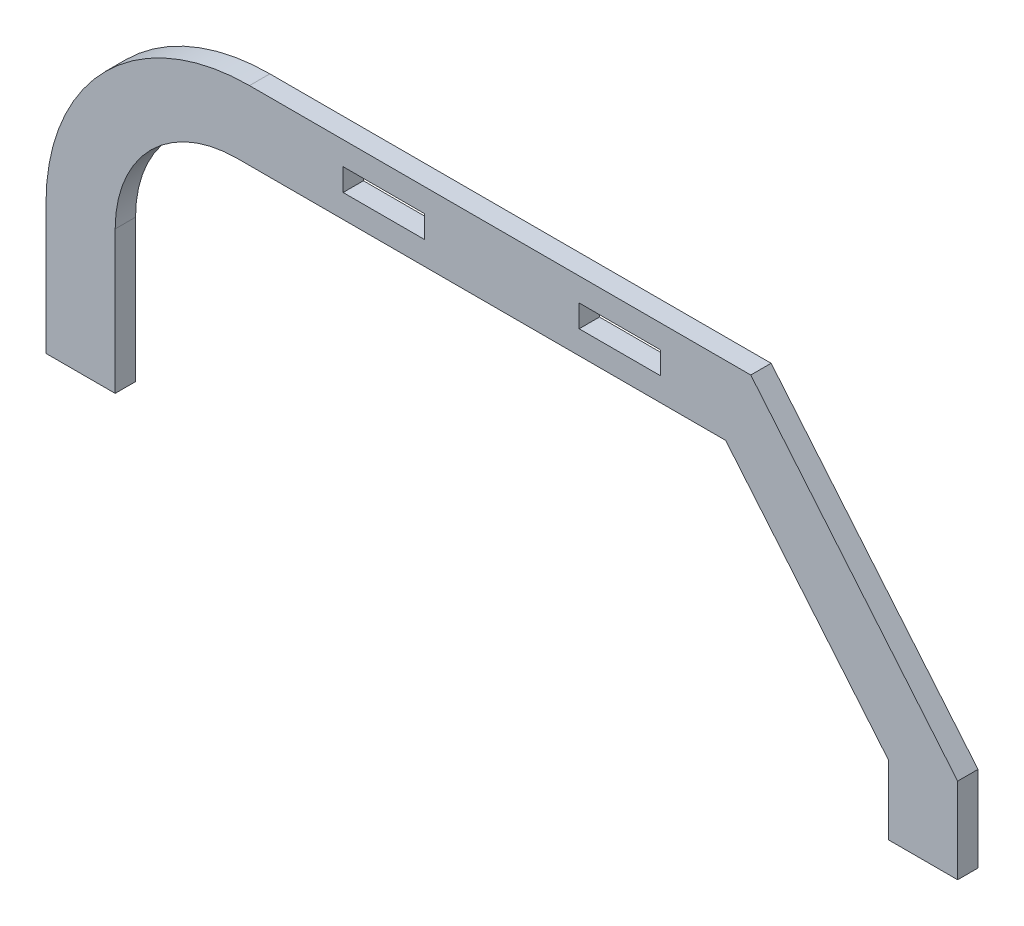
ISO-10303-21;
HEADER;
FILE_DESCRIPTION(('STEP AP214'),'2;1');
FILE_NAME('part.step','',(''),(''),'','','');
FILE_SCHEMA(('AUTOMOTIVE_DESIGN { 1 0 10303 214 1 1 1 1 }'));
ENDSEC;
DATA;
#1=APPLICATION_CONTEXT('core data for automotive mechanical design processes');
#2=APPLICATION_PROTOCOL_DEFINITION('international standard','automotive_design',2000,#1);
#3=PRODUCT_CONTEXT('',#1,'mechanical');
#4=PRODUCT('Part','Part','',(#3));
#5=PRODUCT_RELATED_PRODUCT_CATEGORY('part','',(#4));
#6=PRODUCT_DEFINITION_FORMATION('','',#4);
#7=PRODUCT_DEFINITION_CONTEXT('part definition',#1,'design');
#8=PRODUCT_DEFINITION('design','',#6,#7);
#9=PRODUCT_DEFINITION_SHAPE('','',#8);
#10=(LENGTH_UNIT() NAMED_UNIT(*) SI_UNIT(.MILLI.,.METRE.));
#11=(NAMED_UNIT(*) PLANE_ANGLE_UNIT() SI_UNIT($,.RADIAN.));
#12=(NAMED_UNIT(*) SI_UNIT($,.STERADIAN.) SOLID_ANGLE_UNIT());
#13=UNCERTAINTY_MEASURE_WITH_UNIT(LENGTH_MEASURE(1.E-05),#10,'distance_accuracy_value','');
#14=(GEOMETRIC_REPRESENTATION_CONTEXT(3) GLOBAL_UNCERTAINTY_ASSIGNED_CONTEXT((#13)) GLOBAL_UNIT_ASSIGNED_CONTEXT((#10,
#11,#12)) REPRESENTATION_CONTEXT('',''));
#15=CARTESIAN_POINT('',(0.,0.,0.));
#16=DIRECTION('',(0.,0.,1.));
#17=DIRECTION('',(1.,0.,0.));
#18=AXIS2_PLACEMENT_3D('',#15,#16,#17);
#19=CARTESIAN_POINT('',(-62.,32.,5.));
#20=DIRECTION('',(0.,0.,-1.));
#21=DIRECTION('',(-1.,0.,0.));
#22=AXIS2_PLACEMENT_3D('',#19,#20,#21);
#23=PLANE('',#22);
#24=DIRECTION('',(0.,-1.,0.));
#25=VECTOR('',#24,1.);
#26=CARTESIAN_POINT('',(-39.,76.25,5.));
#27=LINE('',#26,#25);
#28=CARTESIAN_POINT('',(-39.,76.25,5.));
#29=VERTEX_POINT('',#28);
#30=CARTESIAN_POINT('',(-39.,70.75,5.));
#31=VERTEX_POINT('',#30);
#32=EDGE_CURVE('E206',#29,#31,#27,.T.);
#33=ORIENTED_EDGE('',*,*,#32,.F.);
#34=DIRECTION('',(-1.,0.,0.));
#35=VECTOR('',#34,1.);
#36=CARTESIAN_POINT('',(-39.,76.25,5.));
#37=LINE('',#36,#35);
#38=CARTESIAN_POINT('',(-19.,76.25,5.));
#39=VERTEX_POINT('',#38);
#40=EDGE_CURVE('E214',#39,#29,#37,.T.);
#41=ORIENTED_EDGE('',*,*,#40,.F.);
#42=DIRECTION('',(0.,1.,0.));
#43=VECTOR('',#42,1.);
#44=CARTESIAN_POINT('',(-19.,76.25,5.));
#45=LINE('',#44,#43);
#46=CARTESIAN_POINT('',(-19.,70.75,5.));
#47=VERTEX_POINT('',#46);
#48=EDGE_CURVE('E211',#47,#39,#45,.T.);
#49=ORIENTED_EDGE('',*,*,#48,.F.);
#50=DIRECTION('',(1.,0.,0.));
#51=VECTOR('',#50,1.);
#52=CARTESIAN_POINT('',(-39.,70.75,5.));
#53=LINE('',#52,#51);
#54=EDGE_CURVE('E208',#31,#47,#53,.T.);
#55=ORIENTED_EDGE('',*,*,#54,.F.);
#56=EDGE_LOOP('',(#33,#41,#49,#55));
#57=FACE_BOUND('',#56,.T.);
#58=DIRECTION('',(0.,-1.,0.));
#59=VECTOR('',#58,1.);
#60=CARTESIAN_POINT('',(-112.,0.,5.));
#61=LINE('',#60,#59);
#62=CARTESIAN_POINT('',(-112.,31.9999999999996,5.));
#63=VERTEX_POINT('',#62);
#64=CARTESIAN_POINT('',(-112.,0.,5.));
#65=VERTEX_POINT('',#64);
#66=EDGE_CURVE('E237',#63,#65,#61,.T.);
#67=ORIENTED_EDGE('',*,*,#66,.T.);
#68=DIRECTION('',(1.,0.,0.));
#69=VECTOR('',#68,1.);
#70=CARTESIAN_POINT('',(-112.,0.,5.));
#71=LINE('',#70,#69);
#72=CARTESIAN_POINT('',(-95.,0.,5.));
#73=VERTEX_POINT('',#72);
#74=EDGE_CURVE('E240',#65,#73,#71,.T.);
#75=ORIENTED_EDGE('',*,*,#74,.T.);
#76=DIRECTION('',(0.,1.,0.));
#77=VECTOR('',#76,1.);
#78=CARTESIAN_POINT('',(-95.,0.,5.));
#79=LINE('',#78,#77);
#80=CARTESIAN_POINT('',(-95.,34.9999999999998,5.));
#81=VERTEX_POINT('',#80);
#82=EDGE_CURVE('E243',#73,#81,#79,.T.);
#83=ORIENTED_EDGE('',*,*,#82,.T.);
#84=CARTESIAN_POINT('',(-65.,35.,5.));
#85=DIRECTION('',(0.,0.,-1.));
#86=DIRECTION('',(1.,0.,0.));
#87=AXIS2_PLACEMENT_3D('',#84,#85,#86);
#88=CIRCLE('',#87,30.);
#89=CARTESIAN_POINT('',(-64.9999999999998,65.,5.));
#90=VERTEX_POINT('',#89);
#91=EDGE_CURVE('E245',#81,#90,#88,.T.);
#92=ORIENTED_EDGE('',*,*,#91,.T.);
#93=DIRECTION('',(1.,0.,0.));
#94=VECTOR('',#93,1.);
#95=CARTESIAN_POINT('',(-64.9999999999998,65.,5.));
#96=LINE('',#95,#94);
#97=CARTESIAN_POINT('',(55.,65.,5.));
#98=VERTEX_POINT('',#97);
#99=EDGE_CURVE('E247',#90,#98,#96,.T.);
#100=ORIENTED_EDGE('',*,*,#99,.T.);
#101=DIRECTION('',(0.64018439966448,-0.768221279597376,0.));
#102=VECTOR('',#101,1.);
#103=CARTESIAN_POINT('',(95.,17.,5.));
#104=LINE('',#103,#102);
#105=CARTESIAN_POINT('',(95.,17.,5.));
#106=VERTEX_POINT('',#105);
#107=EDGE_CURVE('E249',#98,#106,#104,.T.);
#108=ORIENTED_EDGE('',*,*,#107,.T.);
#109=DIRECTION('',(0.,-1.,0.));
#110=VECTOR('',#109,1.);
#111=CARTESIAN_POINT('',(95.,0.,5.));
#112=LINE('',#111,#110);
#113=CARTESIAN_POINT('',(95.,0.,5.));
#114=VERTEX_POINT('',#113);
#115=EDGE_CURVE('E251',#106,#114,#112,.T.);
#116=ORIENTED_EDGE('',*,*,#115,.T.);
#117=DIRECTION('',(1.,0.,0.));
#118=VECTOR('',#117,1.);
#119=CARTESIAN_POINT('',(112.,0.,5.));
#120=LINE('',#119,#118);
#121=CARTESIAN_POINT('',(112.,0.,5.));
#122=VERTEX_POINT('',#121);
#123=EDGE_CURVE('E253',#114,#122,#120,.T.);
#124=ORIENTED_EDGE('',*,*,#123,.T.);
#125=DIRECTION('',(0.,1.,0.));
#126=VECTOR('',#125,1.);
#127=CARTESIAN_POINT('',(112.,0.,5.));
#128=LINE('',#127,#126);
#129=CARTESIAN_POINT('',(112.,21.,5.));
#130=VERTEX_POINT('',#129);
#131=EDGE_CURVE('E255',#122,#130,#128,.T.);
#132=ORIENTED_EDGE('',*,*,#131,.T.);
#133=DIRECTION('',(-0.64018439966448,0.768221279597376,0.));
#134=VECTOR('',#133,1.);
#135=CARTESIAN_POINT('',(112.,21.,5.));
#136=LINE('',#135,#134);
#137=CARTESIAN_POINT('',(61.1666666666667,82.,5.));
#138=VERTEX_POINT('',#137);
#139=EDGE_CURVE('E257',#130,#138,#136,.T.);
#140=ORIENTED_EDGE('',*,*,#139,.T.);
#141=DIRECTION('',(-1.,0.,0.));
#142=VECTOR('',#141,1.);
#143=CARTESIAN_POINT('',(-61.1666666666667,82.,5.));
#144=LINE('',#143,#142);
#145=CARTESIAN_POINT('',(-61.9999999999996,82.,5.));
#146=VERTEX_POINT('',#145);
#147=EDGE_CURVE('E259',#138,#146,#144,.T.);
#148=ORIENTED_EDGE('',*,*,#147,.T.);
#149=CARTESIAN_POINT('',(-62.,32.,5.));
#150=DIRECTION('',(0.,0.,1.));
#151=DIRECTION('',(-1.,0.,0.));
#152=AXIS2_PLACEMENT_3D('',#149,#150,#151);
#153=CIRCLE('',#152,50.);
#154=EDGE_CURVE('E261',#146,#63,#153,.T.);
#155=ORIENTED_EDGE('',*,*,#154,.T.);
#156=EDGE_LOOP('',(#67,#75,#83,#92,#100,#108,#116,#124,#132,#140,#148,#155));
#157=FACE_BOUND('',#156,.T.);
#158=DIRECTION('',(-1.,0.,0.));
#159=VECTOR('',#158,1.);
#160=CARTESIAN_POINT('',(39.,76.25,5.));
#161=LINE('',#160,#159);
#162=CARTESIAN_POINT('',(39.,76.25,5.));
#163=VERTEX_POINT('',#162);
#164=CARTESIAN_POINT('',(19.,76.25,5.));
#165=VERTEX_POINT('',#164);
#166=EDGE_CURVE('E170',#163,#165,#161,.T.);
#167=ORIENTED_EDGE('',*,*,#166,.F.);
#168=DIRECTION('',(0.,1.,0.));
#169=VECTOR('',#168,1.);
#170=CARTESIAN_POINT('',(39.,76.25,5.));
#171=LINE('',#170,#169);
#172=CARTESIAN_POINT('',(39.,70.75,5.));
#173=VERTEX_POINT('',#172);
#174=EDGE_CURVE('E192',#173,#163,#171,.T.);
#175=ORIENTED_EDGE('',*,*,#174,.F.);
#176=DIRECTION('',(1.,0.,0.));
#177=VECTOR('',#176,1.);
#178=CARTESIAN_POINT('',(39.,70.75,5.));
#179=LINE('',#178,#177);
#180=CARTESIAN_POINT('',(19.,70.75,5.));
#181=VERTEX_POINT('',#180);
#182=EDGE_CURVE('E190',#181,#173,#179,.T.);
#183=ORIENTED_EDGE('',*,*,#182,.F.);
#184=DIRECTION('',(0.,-1.,0.));
#185=VECTOR('',#184,1.);
#186=CARTESIAN_POINT('',(19.,76.25,5.));
#187=LINE('',#186,#185);
#188=EDGE_CURVE('E178',#165,#181,#187,.T.);
#189=ORIENTED_EDGE('',*,*,#188,.F.);
#190=EDGE_LOOP('',(#167,#175,#183,#189));
#191=FACE_BOUND('',#190,.T.);
#192=ADVANCED_FACE('F33',(#57,#157,#191),#23,.F.);
#193=CARTESIAN_POINT('',(-62.,32.,0.));
#194=DIRECTION('',(0.,0.,-1.));
#195=DIRECTION('',(-1.,0.,0.));
#196=AXIS2_PLACEMENT_3D('',#193,#194,#195);
#197=PLANE('',#196);
#198=DIRECTION('',(1.,0.,0.));
#199=VECTOR('',#198,1.);
#200=CARTESIAN_POINT('',(-112.,0.,0.));
#201=LINE('',#200,#199);
#202=CARTESIAN_POINT('',(-112.,0.,0.));
#203=VERTEX_POINT('',#202);
#204=CARTESIAN_POINT('',(-95.,0.,0.));
#205=VERTEX_POINT('',#204);
#206=EDGE_CURVE('E236',#203,#205,#201,.T.);
#207=ORIENTED_EDGE('',*,*,#206,.F.);
#208=DIRECTION('',(0.,-1.,0.));
#209=VECTOR('',#208,1.);
#210=CARTESIAN_POINT('',(-112.,21.,0.));
#211=LINE('',#210,#209);
#212=CARTESIAN_POINT('',(-112.,31.9999999999996,0.));
#213=VERTEX_POINT('',#212);
#214=EDGE_CURVE('E241',#213,#203,#211,.T.);
#215=ORIENTED_EDGE('',*,*,#214,.F.);
#216=CARTESIAN_POINT('',(-62.,32.,0.));
#217=DIRECTION('',(0.,0.,1.));
#218=DIRECTION('',(-1.,0.,0.));
#219=AXIS2_PLACEMENT_3D('',#216,#217,#218);
#220=CIRCLE('',#219,50.);
#221=CARTESIAN_POINT('',(-61.9999999999996,82.,0.));
#222=VERTEX_POINT('',#221);
#223=EDGE_CURVE('E287',#222,#213,#220,.T.);
#224=ORIENTED_EDGE('',*,*,#223,.F.);
#225=DIRECTION('',(-1.,0.,0.));
#226=VECTOR('',#225,1.);
#227=CARTESIAN_POINT('',(-61.9999999999996,82.,0.));
#228=LINE('',#227,#226);
#229=CARTESIAN_POINT('',(61.1666666666667,82.,0.));
#230=VERTEX_POINT('',#229);
#231=EDGE_CURVE('E285',#230,#222,#228,.T.);
#232=ORIENTED_EDGE('',*,*,#231,.F.);
#233=DIRECTION('',(-0.64018439966448,0.768221279597376,0.));
#234=VECTOR('',#233,1.);
#235=CARTESIAN_POINT('',(112.,21.,0.));
#236=LINE('',#235,#234);
#237=CARTESIAN_POINT('',(112.,21.,0.));
#238=VERTEX_POINT('',#237);
#239=EDGE_CURVE('E282',#238,#230,#236,.T.);
#240=ORIENTED_EDGE('',*,*,#239,.F.);
#241=DIRECTION('',(0.,1.,0.));
#242=VECTOR('',#241,1.);
#243=CARTESIAN_POINT('',(112.,0.,0.));
#244=LINE('',#243,#242);
#245=CARTESIAN_POINT('',(112.,0.,0.));
#246=VERTEX_POINT('',#245);
#247=EDGE_CURVE('E280',#246,#238,#244,.T.);
#248=ORIENTED_EDGE('',*,*,#247,.F.);
#249=DIRECTION('',(1.,0.,0.));
#250=VECTOR('',#249,1.);
#251=CARTESIAN_POINT('',(112.,0.,0.));
#252=LINE('',#251,#250);
#253=CARTESIAN_POINT('',(95.,0.,0.));
#254=VERTEX_POINT('',#253);
#255=EDGE_CURVE('E278',#254,#246,#252,.T.);
#256=ORIENTED_EDGE('',*,*,#255,.F.);
#257=DIRECTION('',(0.,-1.,0.));
#258=VECTOR('',#257,1.);
#259=CARTESIAN_POINT('',(95.,0.,0.));
#260=LINE('',#259,#258);
#261=CARTESIAN_POINT('',(95.,17.,0.));
#262=VERTEX_POINT('',#261);
#263=EDGE_CURVE('E276',#262,#254,#260,.T.);
#264=ORIENTED_EDGE('',*,*,#263,.F.);
#265=DIRECTION('',(0.64018439966448,-0.768221279597376,0.));
#266=VECTOR('',#265,1.);
#267=CARTESIAN_POINT('',(95.,17.,0.));
#268=LINE('',#267,#266);
#269=CARTESIAN_POINT('',(55.,65.,0.));
#270=VERTEX_POINT('',#269);
#271=EDGE_CURVE('E274',#270,#262,#268,.T.);
#272=ORIENTED_EDGE('',*,*,#271,.F.);
#273=DIRECTION('',(1.,0.,0.));
#274=VECTOR('',#273,1.);
#275=CARTESIAN_POINT('',(-55.,65.,0.));
#276=LINE('',#275,#274);
#277=CARTESIAN_POINT('',(-64.9999999999998,65.,0.));
#278=VERTEX_POINT('',#277);
#279=EDGE_CURVE('E272',#278,#270,#276,.T.);
#280=ORIENTED_EDGE('',*,*,#279,.F.);
#281=CARTESIAN_POINT('',(-65.,35.,0.));
#282=DIRECTION('',(0.,0.,-1.));
#283=DIRECTION('',(1.,0.,0.));
#284=AXIS2_PLACEMENT_3D('',#281,#282,#283);
#285=CIRCLE('',#284,30.);
#286=CARTESIAN_POINT('',(-95.,34.9999999999998,0.));
#287=VERTEX_POINT('',#286);
#288=EDGE_CURVE('E269',#287,#278,#285,.T.);
#289=ORIENTED_EDGE('',*,*,#288,.F.);
#290=DIRECTION('',(0.,1.,0.));
#291=VECTOR('',#290,1.);
#292=CARTESIAN_POINT('',(-95.,17.,0.));
#293=LINE('',#292,#291);
#294=EDGE_CURVE('E267',#205,#287,#293,.T.);
#295=ORIENTED_EDGE('',*,*,#294,.F.);
#296=EDGE_LOOP('',(#207,#215,#224,#232,#240,#248,#256,#264,#272,#280,#289,#295));
#297=FACE_BOUND('',#296,.T.);
#298=DIRECTION('',(-1.,0.,0.));
#299=VECTOR('',#298,1.);
#300=CARTESIAN_POINT('',(-39.,76.25,0.));
#301=LINE('',#300,#299);
#302=CARTESIAN_POINT('',(-19.,76.25,0.));
#303=VERTEX_POINT('',#302);
#304=CARTESIAN_POINT('',(-39.,76.25,0.));
#305=VERTEX_POINT('',#304);
#306=EDGE_CURVE('E209',#303,#305,#301,.T.);
#307=ORIENTED_EDGE('',*,*,#306,.T.);
#308=DIRECTION('',(0.,-1.,0.));
#309=VECTOR('',#308,1.);
#310=CARTESIAN_POINT('',(-39.,76.25,0.));
#311=LINE('',#310,#309);
#312=CARTESIAN_POINT('',(-39.,70.75,0.));
#313=VERTEX_POINT('',#312);
#314=EDGE_CURVE('E186',#305,#313,#311,.T.);
#315=ORIENTED_EDGE('',*,*,#314,.T.);
#316=DIRECTION('',(1.,0.,0.));
#317=VECTOR('',#316,1.);
#318=CARTESIAN_POINT('',(-39.,70.75,0.));
#319=LINE('',#318,#317);
#320=CARTESIAN_POINT('',(-19.,70.75,0.));
#321=VERTEX_POINT('',#320);
#322=EDGE_CURVE('E219',#313,#321,#319,.T.);
#323=ORIENTED_EDGE('',*,*,#322,.T.);
#324=DIRECTION('',(0.,1.,0.));
#325=VECTOR('',#324,1.);
#326=CARTESIAN_POINT('',(-19.,76.25,0.));
#327=LINE('',#326,#325);
#328=EDGE_CURVE('E222',#321,#303,#327,.T.);
#329=ORIENTED_EDGE('',*,*,#328,.T.);
#330=EDGE_LOOP('',(#307,#315,#323,#329));
#331=FACE_BOUND('',#330,.T.);
#332=DIRECTION('',(0.,1.,0.));
#333=VECTOR('',#332,1.);
#334=CARTESIAN_POINT('',(39.,76.25,0.));
#335=LINE('',#334,#333);
#336=CARTESIAN_POINT('',(39.,70.75,0.));
#337=VERTEX_POINT('',#336);
#338=CARTESIAN_POINT('',(39.,76.25,0.));
#339=VERTEX_POINT('',#338);
#340=EDGE_CURVE('E179',#337,#339,#335,.T.);
#341=ORIENTED_EDGE('',*,*,#340,.T.);
#342=DIRECTION('',(-1.,0.,0.));
#343=VECTOR('',#342,1.);
#344=CARTESIAN_POINT('',(39.,76.25,0.));
#345=LINE('',#344,#343);
#346=CARTESIAN_POINT('',(19.,76.25,0.));
#347=VERTEX_POINT('',#346);
#348=EDGE_CURVE('E56',#339,#347,#345,.T.);
#349=ORIENTED_EDGE('',*,*,#348,.T.);
#350=DIRECTION('',(0.,-1.,0.));
#351=VECTOR('',#350,1.);
#352=CARTESIAN_POINT('',(19.,76.25,0.));
#353=LINE('',#352,#351);
#354=CARTESIAN_POINT('',(19.,70.75,0.));
#355=VERTEX_POINT('',#354);
#356=EDGE_CURVE('E185',#347,#355,#353,.T.);
#357=ORIENTED_EDGE('',*,*,#356,.T.);
#358=DIRECTION('',(1.,0.,0.));
#359=VECTOR('',#358,1.);
#360=CARTESIAN_POINT('',(39.,70.75,0.));
#361=LINE('',#360,#359);
#362=EDGE_CURVE('E198',#355,#337,#361,.T.);
#363=ORIENTED_EDGE('',*,*,#362,.T.);
#364=EDGE_LOOP('',(#341,#349,#357,#363));
#365=FACE_BOUND('',#364,.T.);
#366=ADVANCED_FACE('F329',(#297,#331,#365),#197,.T.);
#367=CARTESIAN_POINT('',(-112.,0.,5.));
#368=DIRECTION('',(0.,1.,0.));
#369=DIRECTION('',(0.,0.,1.));
#370=AXIS2_PLACEMENT_3D('',#367,#368,#369);
#371=PLANE('',#370);
#372=ORIENTED_EDGE('',*,*,#206,.T.);
#373=DIRECTION('',(0.,0.,-1.));
#374=VECTOR('',#373,1.);
#375=CARTESIAN_POINT('',(-95.,0.,5.));
#376=LINE('',#375,#374);
#377=EDGE_CURVE('E41',#73,#205,#376,.T.);
#378=ORIENTED_EDGE('',*,*,#377,.F.);
#379=ORIENTED_EDGE('',*,*,#74,.F.);
#380=DIRECTION('',(0.,0.,-1.));
#381=VECTOR('',#380,1.);
#382=CARTESIAN_POINT('',(-112.,0.,5.));
#383=LINE('',#382,#381);
#384=EDGE_CURVE('E11',#65,#203,#383,.T.);
#385=ORIENTED_EDGE('',*,*,#384,.T.);
#386=EDGE_LOOP('',(#372,#378,#379,#385));
#387=FACE_BOUND('',#386,.T.);
#388=ADVANCED_FACE('F35',(#387),#371,.F.);
#389=CARTESIAN_POINT('',(-95.,17.,5.));
#390=DIRECTION('',(-1.,0.,0.));
#391=DIRECTION('',(0.,0.,1.));
#392=AXIS2_PLACEMENT_3D('',#389,#390,#391);
#393=PLANE('',#392);
#394=ORIENTED_EDGE('',*,*,#294,.T.);
#395=DIRECTION('',(0.,0.,-1.));
#396=VECTOR('',#395,1.);
#397=CARTESIAN_POINT('',(-95.,34.9999999999998,5.));
#398=LINE('',#397,#396);
#399=EDGE_CURVE('E316',#81,#287,#398,.T.);
#400=ORIENTED_EDGE('',*,*,#399,.F.);
#401=ORIENTED_EDGE('',*,*,#82,.F.);
#402=ORIENTED_EDGE('',*,*,#377,.T.);
#403=EDGE_LOOP('',(#394,#400,#401,#402));
#404=FACE_BOUND('',#403,.T.);
#405=ADVANCED_FACE('F322',(#404),#393,.F.);
#406=CARTESIAN_POINT('',(-65.,35.,5.));
#407=DIRECTION('',(0.,0.,-1.));
#408=DIRECTION('',(-1.,0.,0.));
#409=AXIS2_PLACEMENT_3D('',#406,#407,#408);
#410=CYLINDRICAL_SURFACE('',#409,30.);
#411=ORIENTED_EDGE('',*,*,#288,.T.);
#412=DIRECTION('',(0.,0.,-1.));
#413=VECTOR('',#412,1.);
#414=CARTESIAN_POINT('',(-64.9999999999998,65.,5.));
#415=LINE('',#414,#413);
#416=EDGE_CURVE('E313',#90,#278,#415,.T.);
#417=ORIENTED_EDGE('',*,*,#416,.F.);
#418=ORIENTED_EDGE('',*,*,#91,.F.);
#419=ORIENTED_EDGE('',*,*,#399,.T.);
#420=EDGE_LOOP('',(#411,#417,#418,#419));
#421=FACE_BOUND('',#420,.T.);
#422=ADVANCED_FACE('F336',(#421),#410,.F.);
#423=CARTESIAN_POINT('',(-55.,65.,5.));
#424=DIRECTION('',(0.,1.,0.));
#425=DIRECTION('',(0.,0.,1.));
#426=AXIS2_PLACEMENT_3D('',#423,#424,#425);
#427=PLANE('',#426);
#428=ORIENTED_EDGE('',*,*,#279,.T.);
#429=DIRECTION('',(0.,0.,-1.));
#430=VECTOR('',#429,1.);
#431=CARTESIAN_POINT('',(55.,65.,5.));
#432=LINE('',#431,#430);
#433=EDGE_CURVE('E310',#98,#270,#432,.T.);
#434=ORIENTED_EDGE('',*,*,#433,.F.);
#435=ORIENTED_EDGE('',*,*,#99,.F.);
#436=ORIENTED_EDGE('',*,*,#416,.T.);
#437=EDGE_LOOP('',(#428,#434,#435,#436));
#438=FACE_BOUND('',#437,.T.);
#439=ADVANCED_FACE('F340',(#438),#427,.F.);
#440=CARTESIAN_POINT('',(95.,17.,5.));
#441=DIRECTION('',(0.768221279597376,0.64018439966448,0.));
#442=DIRECTION('',(-0.64018439966448,0.768221279597376,0.));
#443=AXIS2_PLACEMENT_3D('',#440,#441,#442);
#444=PLANE('',#443);
#445=ORIENTED_EDGE('',*,*,#271,.T.);
#446=DIRECTION('',(0.,0.,-1.));
#447=VECTOR('',#446,1.);
#448=CARTESIAN_POINT('',(95.,17.,5.));
#449=LINE('',#448,#447);
#450=EDGE_CURVE('E307',#106,#262,#449,.T.);
#451=ORIENTED_EDGE('',*,*,#450,.F.);
#452=ORIENTED_EDGE('',*,*,#107,.F.);
#453=ORIENTED_EDGE('',*,*,#433,.T.);
#454=EDGE_LOOP('',(#445,#451,#452,#453));
#455=FACE_BOUND('',#454,.T.);
#456=ADVANCED_FACE('F376',(#455),#444,.F.);
#457=CARTESIAN_POINT('',(95.,0.,5.));
#458=DIRECTION('',(1.,0.,0.));
#459=DIRECTION('',(0.,0.,-1.));
#460=AXIS2_PLACEMENT_3D('',#457,#458,#459);
#461=PLANE('',#460);
#462=ORIENTED_EDGE('',*,*,#263,.T.);
#463=DIRECTION('',(0.,0.,-1.));
#464=VECTOR('',#463,1.);
#465=CARTESIAN_POINT('',(95.,0.,5.));
#466=LINE('',#465,#464);
#467=EDGE_CURVE('E304',#114,#254,#466,.T.);
#468=ORIENTED_EDGE('',*,*,#467,.F.);
#469=ORIENTED_EDGE('',*,*,#115,.F.);
#470=ORIENTED_EDGE('',*,*,#450,.T.);
#471=EDGE_LOOP('',(#462,#468,#469,#470));
#472=FACE_BOUND('',#471,.T.);
#473=ADVANCED_FACE('F374',(#472),#461,.F.);
#474=CARTESIAN_POINT('',(112.,0.,5.));
#475=DIRECTION('',(0.,1.,0.));
#476=DIRECTION('',(0.,0.,1.));
#477=AXIS2_PLACEMENT_3D('',#474,#475,#476);
#478=PLANE('',#477);
#479=ORIENTED_EDGE('',*,*,#255,.T.);
#480=DIRECTION('',(0.,0.,-1.));
#481=VECTOR('',#480,1.);
#482=CARTESIAN_POINT('',(112.,0.,5.));
#483=LINE('',#482,#481);
#484=EDGE_CURVE('E301',#122,#246,#483,.T.);
#485=ORIENTED_EDGE('',*,*,#484,.F.);
#486=ORIENTED_EDGE('',*,*,#123,.F.);
#487=ORIENTED_EDGE('',*,*,#467,.T.);
#488=EDGE_LOOP('',(#479,#485,#486,#487));
#489=FACE_BOUND('',#488,.T.);
#490=ADVANCED_FACE('F370',(#489),#478,.F.);
#491=CARTESIAN_POINT('',(112.,0.,5.));
#492=DIRECTION('',(-1.,0.,0.));
#493=DIRECTION('',(0.,0.,1.));
#494=AXIS2_PLACEMENT_3D('',#491,#492,#493);
#495=PLANE('',#494);
#496=ORIENTED_EDGE('',*,*,#247,.T.);
#497=DIRECTION('',(0.,0.,-1.));
#498=VECTOR('',#497,1.);
#499=CARTESIAN_POINT('',(112.,21.,5.));
#500=LINE('',#499,#498);
#501=EDGE_CURVE('E298',#130,#238,#500,.T.);
#502=ORIENTED_EDGE('',*,*,#501,.F.);
#503=ORIENTED_EDGE('',*,*,#131,.F.);
#504=ORIENTED_EDGE('',*,*,#484,.T.);
#505=EDGE_LOOP('',(#496,#502,#503,#504));
#506=FACE_BOUND('',#505,.T.);
#507=ADVANCED_FACE('F366',(#506),#495,.F.);
#508=CARTESIAN_POINT('',(112.,21.,5.));
#509=DIRECTION('',(-0.768221279597376,-0.64018439966448,0.));
#510=DIRECTION('',(0.64018439966448,-0.768221279597376,0.));
#511=AXIS2_PLACEMENT_3D('',#508,#509,#510);
#512=PLANE('',#511);
#513=ORIENTED_EDGE('',*,*,#239,.T.);
#514=DIRECTION('',(0.,0.,-1.));
#515=VECTOR('',#514,1.);
#516=CARTESIAN_POINT('',(61.1666666666667,82.,5.));
#517=LINE('',#516,#515);
#518=EDGE_CURVE('E295',#138,#230,#517,.T.);
#519=ORIENTED_EDGE('',*,*,#518,.F.);
#520=ORIENTED_EDGE('',*,*,#139,.F.);
#521=ORIENTED_EDGE('',*,*,#501,.T.);
#522=EDGE_LOOP('',(#513,#519,#520,#521));
#523=FACE_BOUND('',#522,.T.);
#524=ADVANCED_FACE('F357',(#523),#512,.F.);
#525=CARTESIAN_POINT('',(-61.9999999999996,82.,5.));
#526=DIRECTION('',(0.,-1.,0.));
#527=DIRECTION('',(0.,0.,-1.));
#528=AXIS2_PLACEMENT_3D('',#525,#526,#527);
#529=PLANE('',#528);
#530=ORIENTED_EDGE('',*,*,#231,.T.);
#531=DIRECTION('',(0.,0.,-1.));
#532=VECTOR('',#531,1.);
#533=CARTESIAN_POINT('',(-61.9999999999996,82.,5.));
#534=LINE('',#533,#532);
#535=EDGE_CURVE('E292',#146,#222,#534,.T.);
#536=ORIENTED_EDGE('',*,*,#535,.F.);
#537=ORIENTED_EDGE('',*,*,#147,.F.);
#538=ORIENTED_EDGE('',*,*,#518,.T.);
#539=EDGE_LOOP('',(#530,#536,#537,#538));
#540=FACE_BOUND('',#539,.T.);
#541=ADVANCED_FACE('F361',(#540),#529,.F.);
#542=CARTESIAN_POINT('',(-62.,32.,5.));
#543=DIRECTION('',(0.,0.,-1.));
#544=DIRECTION('',(-1.,0.,0.));
#545=AXIS2_PLACEMENT_3D('',#542,#543,#544);
#546=CYLINDRICAL_SURFACE('',#545,50.);
#547=ORIENTED_EDGE('',*,*,#223,.T.);
#548=DIRECTION('',(0.,0.,-1.));
#549=VECTOR('',#548,1.);
#550=CARTESIAN_POINT('',(-112.,31.9999999999996,5.));
#551=LINE('',#550,#549);
#552=EDGE_CURVE('E264',#63,#213,#551,.T.);
#553=ORIENTED_EDGE('',*,*,#552,.F.);
#554=ORIENTED_EDGE('',*,*,#154,.F.);
#555=ORIENTED_EDGE('',*,*,#535,.T.);
#556=EDGE_LOOP('',(#547,#553,#554,#555));
#557=FACE_BOUND('',#556,.T.);
#558=ADVANCED_FACE('F350',(#557),#546,.T.);
#559=CARTESIAN_POINT('',(-112.,21.,5.));
#560=DIRECTION('',(1.,0.,0.));
#561=DIRECTION('',(0.,0.,-1.));
#562=AXIS2_PLACEMENT_3D('',#559,#560,#561);
#563=PLANE('',#562);
#564=ORIENTED_EDGE('',*,*,#214,.T.);
#565=ORIENTED_EDGE('',*,*,#384,.F.);
#566=ORIENTED_EDGE('',*,*,#66,.F.);
#567=ORIENTED_EDGE('',*,*,#552,.T.);
#568=EDGE_LOOP('',(#564,#565,#566,#567));
#569=FACE_BOUND('',#568,.T.);
#570=ADVANCED_FACE('F348',(#569),#563,.F.);
#571=CARTESIAN_POINT('',(-39.,76.25,5.));
#572=DIRECTION('',(1.,0.,0.));
#573=DIRECTION('',(0.,0.,-1.));
#574=AXIS2_PLACEMENT_3D('',#571,#572,#573);
#575=PLANE('',#574);
#576=ORIENTED_EDGE('',*,*,#314,.F.);
#577=DIRECTION('',(0.,0.,-1.));
#578=VECTOR('',#577,1.);
#579=CARTESIAN_POINT('',(-39.,76.25,5.));
#580=LINE('',#579,#578);
#581=EDGE_CURVE('E216',#29,#305,#580,.T.);
#582=ORIENTED_EDGE('',*,*,#581,.F.);
#583=ORIENTED_EDGE('',*,*,#32,.T.);
#584=DIRECTION('',(0.,0.,-1.));
#585=VECTOR('',#584,1.);
#586=CARTESIAN_POINT('',(-39.,70.75,5.));
#587=LINE('',#586,#585);
#588=EDGE_CURVE('E233',#31,#313,#587,.T.);
#589=ORIENTED_EDGE('',*,*,#588,.T.);
#590=EDGE_LOOP('',(#576,#582,#583,#589));
#591=FACE_BOUND('',#590,.T.);
#592=ADVANCED_FACE('F394',(#591),#575,.T.);
#593=CARTESIAN_POINT('',(-39.,70.75,5.));
#594=DIRECTION('',(0.,1.,0.));
#595=DIRECTION('',(0.,0.,1.));
#596=AXIS2_PLACEMENT_3D('',#593,#594,#595);
#597=PLANE('',#596);
#598=ORIENTED_EDGE('',*,*,#322,.F.);
#599=ORIENTED_EDGE('',*,*,#588,.F.);
#600=ORIENTED_EDGE('',*,*,#54,.T.);
#601=DIRECTION('',(0.,0.,-1.));
#602=VECTOR('',#601,1.);
#603=CARTESIAN_POINT('',(-19.,70.75,5.));
#604=LINE('',#603,#602);
#605=EDGE_CURVE('E231',#47,#321,#604,.T.);
#606=ORIENTED_EDGE('',*,*,#605,.T.);
#607=EDGE_LOOP('',(#598,#599,#600,#606));
#608=FACE_BOUND('',#607,.T.);
#609=ADVANCED_FACE('F438',(#608),#597,.T.);
#610=CARTESIAN_POINT('',(-19.,76.25,5.));
#611=DIRECTION('',(-1.,0.,0.));
#612=DIRECTION('',(0.,-1.,0.));
#613=AXIS2_PLACEMENT_3D('',#610,#611,#612);
#614=PLANE('',#613);
#615=ORIENTED_EDGE('',*,*,#328,.F.);
#616=ORIENTED_EDGE('',*,*,#605,.F.);
#617=ORIENTED_EDGE('',*,*,#48,.T.);
#618=DIRECTION('',(0.,0.,-1.));
#619=VECTOR('',#618,1.);
#620=CARTESIAN_POINT('',(-19.,76.25,5.));
#621=LINE('',#620,#619);
#622=EDGE_CURVE('E229',#39,#303,#621,.T.);
#623=ORIENTED_EDGE('',*,*,#622,.T.);
#624=EDGE_LOOP('',(#615,#616,#617,#623));
#625=FACE_BOUND('',#624,.T.);
#626=ADVANCED_FACE('F445',(#625),#614,.T.);
#627=CARTESIAN_POINT('',(-39.,76.25,5.));
#628=DIRECTION('',(0.,-1.,0.));
#629=DIRECTION('',(0.,0.,-1.));
#630=AXIS2_PLACEMENT_3D('',#627,#628,#629);
#631=PLANE('',#630);
#632=ORIENTED_EDGE('',*,*,#306,.F.);
#633=ORIENTED_EDGE('',*,*,#622,.F.);
#634=ORIENTED_EDGE('',*,*,#40,.T.);
#635=ORIENTED_EDGE('',*,*,#581,.T.);
#636=EDGE_LOOP('',(#632,#633,#634,#635));
#637=FACE_BOUND('',#636,.T.);
#638=ADVANCED_FACE('F452',(#637),#631,.T.);
#639=CARTESIAN_POINT('',(39.,76.25,5.));
#640=DIRECTION('',(0.,-1.,0.));
#641=DIRECTION('',(0.,0.,-1.));
#642=AXIS2_PLACEMENT_3D('',#639,#640,#641);
#643=PLANE('',#642);
#644=ORIENTED_EDGE('',*,*,#348,.F.);
#645=DIRECTION('',(0.,0.,-1.));
#646=VECTOR('',#645,1.);
#647=CARTESIAN_POINT('',(39.,76.25,5.));
#648=LINE('',#647,#646);
#649=EDGE_CURVE('E174',#163,#339,#648,.T.);
#650=ORIENTED_EDGE('',*,*,#649,.F.);
#651=ORIENTED_EDGE('',*,*,#166,.T.);
#652=DIRECTION('',(0.,0.,-1.));
#653=VECTOR('',#652,1.);
#654=CARTESIAN_POINT('',(19.,76.25,5.));
#655=LINE('',#654,#653);
#656=EDGE_CURVE('E173',#165,#347,#655,.T.);
#657=ORIENTED_EDGE('',*,*,#656,.T.);
#658=EDGE_LOOP('',(#644,#650,#651,#657));
#659=FACE_BOUND('',#658,.T.);
#660=ADVANCED_FACE('F172',(#659),#643,.T.);
#661=CARTESIAN_POINT('',(19.,76.25,5.));
#662=DIRECTION('',(1.,0.,0.));
#663=DIRECTION('',(0.,1.,0.));
#664=AXIS2_PLACEMENT_3D('',#661,#662,#663);
#665=PLANE('',#664);
#666=ORIENTED_EDGE('',*,*,#356,.F.);
#667=ORIENTED_EDGE('',*,*,#656,.F.);
#668=ORIENTED_EDGE('',*,*,#188,.T.);
#669=DIRECTION('',(0.,0.,-1.));
#670=VECTOR('',#669,1.);
#671=CARTESIAN_POINT('',(19.,70.75,5.));
#672=LINE('',#671,#670);
#673=EDGE_CURVE('E187',#181,#355,#672,.T.);
#674=ORIENTED_EDGE('',*,*,#673,.T.);
#675=EDGE_LOOP('',(#666,#667,#668,#674));
#676=FACE_BOUND('',#675,.T.);
#677=ADVANCED_FACE('F182',(#676),#665,.T.);
#678=CARTESIAN_POINT('',(39.,70.75,5.));
#679=DIRECTION('',(0.,1.,0.));
#680=DIRECTION('',(0.,0.,1.));
#681=AXIS2_PLACEMENT_3D('',#678,#679,#680);
#682=PLANE('',#681);
#683=ORIENTED_EDGE('',*,*,#362,.F.);
#684=ORIENTED_EDGE('',*,*,#673,.F.);
#685=ORIENTED_EDGE('',*,*,#182,.T.);
#686=DIRECTION('',(0.,0.,-1.));
#687=VECTOR('',#686,1.);
#688=CARTESIAN_POINT('',(39.,70.75,5.));
#689=LINE('',#688,#687);
#690=EDGE_CURVE('E48',#173,#337,#689,.T.);
#691=ORIENTED_EDGE('',*,*,#690,.T.);
#692=EDGE_LOOP('',(#683,#684,#685,#691));
#693=FACE_BOUND('',#692,.T.);
#694=ADVANCED_FACE('F473',(#693),#682,.T.);
#695=CARTESIAN_POINT('',(39.,76.25,5.));
#696=DIRECTION('',(-1.,0.,0.));
#697=DIRECTION('',(0.,0.,1.));
#698=AXIS2_PLACEMENT_3D('',#695,#696,#697);
#699=PLANE('',#698);
#700=ORIENTED_EDGE('',*,*,#340,.F.);
#701=ORIENTED_EDGE('',*,*,#690,.F.);
#702=ORIENTED_EDGE('',*,*,#174,.T.);
#703=ORIENTED_EDGE('',*,*,#649,.T.);
#704=EDGE_LOOP('',(#700,#701,#702,#703));
#705=FACE_BOUND('',#704,.T.);
#706=ADVANCED_FACE('F480',(#705),#699,.T.);
#707=CLOSED_SHELL('',(#192,#366,#388,#405,#422,#439,#456,#473,#490,#507,#524,#541,#558,#570,
#592,#609,#626,#638,#660,#677,#694,#706));
#708=MANIFOLD_SOLID_BREP('B2',#707);
#709=ADVANCED_BREP_SHAPE_REPRESENTATION('',(#18,#708),#14);
#710=SHAPE_DEFINITION_REPRESENTATION(#9,#709);
ENDSEC;
END-ISO-10303-21;
